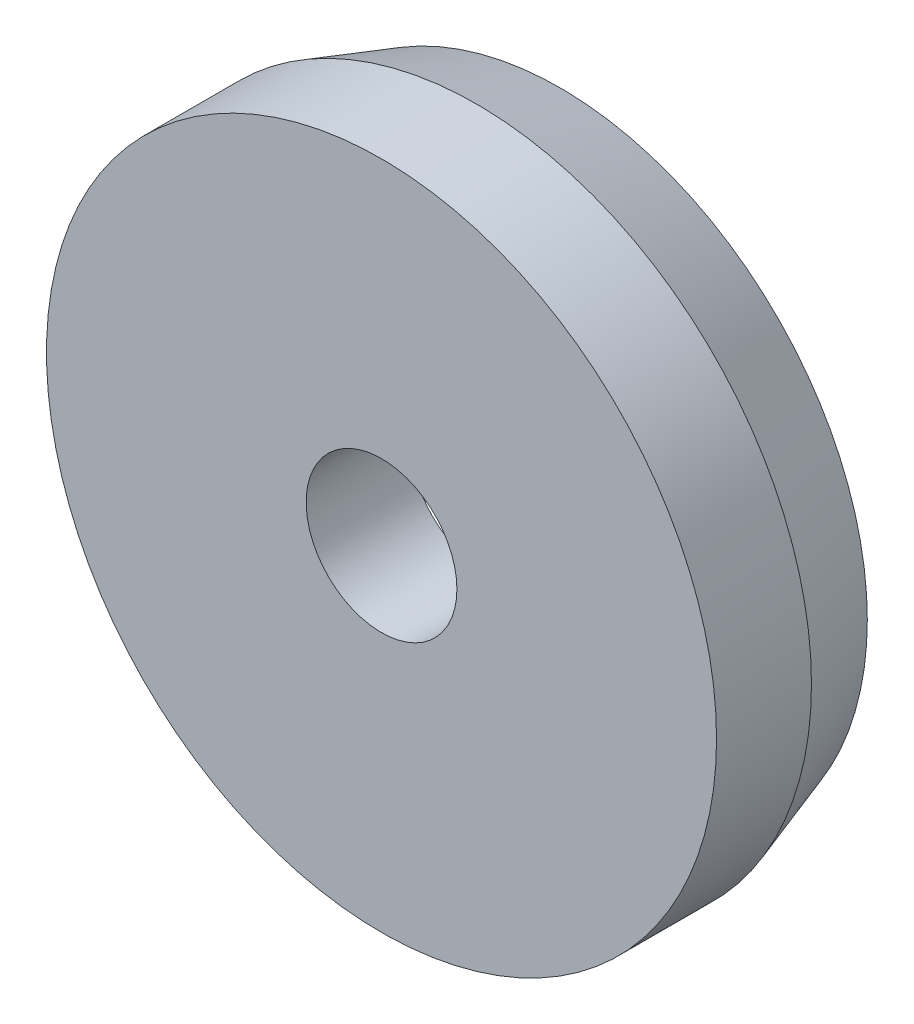
ISO-10303-21;
HEADER;
FILE_DESCRIPTION(('STEP AP214'),'2;1');
FILE_NAME('part.step','',(''),(''),'','','');
FILE_SCHEMA(('AUTOMOTIVE_DESIGN { 1 0 10303 214 1 1 1 1 }'));
ENDSEC;
DATA;
#1=APPLICATION_CONTEXT('core data for automotive mechanical design processes');
#2=APPLICATION_PROTOCOL_DEFINITION('international standard','automotive_design',2000,#1);
#3=PRODUCT_CONTEXT('',#1,'mechanical');
#4=PRODUCT('Part','Part','',(#3));
#5=PRODUCT_RELATED_PRODUCT_CATEGORY('part','',(#4));
#6=PRODUCT_DEFINITION_FORMATION('','',#4);
#7=PRODUCT_DEFINITION_CONTEXT('part definition',#1,'design');
#8=PRODUCT_DEFINITION('design','',#6,#7);
#9=PRODUCT_DEFINITION_SHAPE('','',#8);
#10=(LENGTH_UNIT() NAMED_UNIT(*) SI_UNIT(.MILLI.,.METRE.));
#11=(NAMED_UNIT(*) PLANE_ANGLE_UNIT() SI_UNIT($,.RADIAN.));
#12=(NAMED_UNIT(*) SI_UNIT($,.STERADIAN.) SOLID_ANGLE_UNIT());
#13=UNCERTAINTY_MEASURE_WITH_UNIT(LENGTH_MEASURE(1.E-05),#10,'distance_accuracy_value','');
#14=(GEOMETRIC_REPRESENTATION_CONTEXT(3) GLOBAL_UNCERTAINTY_ASSIGNED_CONTEXT((#13)) GLOBAL_UNIT_ASSIGNED_CONTEXT((#10,
#11,#12)) REPRESENTATION_CONTEXT('',''));
#15=CARTESIAN_POINT('',(0.,0.,0.));
#16=DIRECTION('',(0.,0.,1.));
#17=DIRECTION('',(1.,0.,0.));
#18=AXIS2_PLACEMENT_3D('',#15,#16,#17);
#19=CARTESIAN_POINT('',(0.,-10.25,-1.99));
#20=DIRECTION('',(0.,0.,1.));
#21=DIRECTION('',(1.,0.,0.));
#22=AXIS2_PLACEMENT_3D('',#19,#20,#21);
#23=CYLINDRICAL_SURFACE('',#22,0.600000000000001);
#24=CARTESIAN_POINT('',(0.,-10.25,-1.84));
#25=DIRECTION('',(0.,0.,1.));
#26=DIRECTION('',(1.,0.,0.));
#27=AXIS2_PLACEMENT_3D('',#24,#25,#26);
#28=CIRCLE('',#27,0.600000000000001);
#29=CARTESIAN_POINT('',(0.6,-10.25,-1.84));
#30=VERTEX_POINT('',#29);
#31=EDGE_CURVE('E52',#30,#30,#28,.T.);
#32=ORIENTED_EDGE('',*,*,#31,.T.);
#33=EDGE_LOOP('',(#32));
#34=FACE_BOUND('',#33,.T.);
#35=CARTESIAN_POINT('',(0.,-10.25,-1.67));
#36=DIRECTION('',(0.,0.,1.));
#37=DIRECTION('',(1.,0.,0.));
#38=AXIS2_PLACEMENT_3D('',#35,#36,#37);
#39=CIRCLE('',#38,0.600000000000001);
#40=CARTESIAN_POINT('',(0.6,-10.25,-1.67));
#41=VERTEX_POINT('',#40);
#42=EDGE_CURVE('E10',#41,#41,#39,.T.);
#43=ORIENTED_EDGE('',*,*,#42,.F.);
#44=EDGE_LOOP('',(#43));
#45=FACE_BOUND('',#44,.T.);
#46=ADVANCED_FACE('F30',(#34,#45),#23,.T.);
#47=CARTESIAN_POINT('',(0.134999999999999,-10.25,-1.67));
#48=DIRECTION('',(0.,0.,1.));
#49=DIRECTION('',(1.,0.,0.));
#50=AXIS2_PLACEMENT_3D('',#47,#48,#49);
#51=PLANE('',#50);
#52=ORIENTED_EDGE('',*,*,#42,.T.);
#53=EDGE_LOOP('',(#52));
#54=FACE_BOUND('',#53,.T.);
#55=CARTESIAN_POINT('',(0.,-10.25,-1.67));
#56=DIRECTION('',(0.,0.,1.));
#57=DIRECTION('',(1.,0.,0.));
#58=AXIS2_PLACEMENT_3D('',#55,#56,#57);
#59=CIRCLE('',#58,0.135);
#60=CARTESIAN_POINT('',(0.134999999999999,-10.25,-1.67));
#61=VERTEX_POINT('',#60);
#62=EDGE_CURVE('E36',#61,#61,#59,.T.);
#63=ORIENTED_EDGE('',*,*,#62,.F.);
#64=EDGE_LOOP('',(#63));
#65=FACE_BOUND('',#64,.T.);
#66=ADVANCED_FACE('F70',(#54,#65),#51,.T.);
#67=CARTESIAN_POINT('',(0.,-10.25,-1.99));
#68=DIRECTION('',(0.,0.,1.));
#69=DIRECTION('',(1.,0.,0.));
#70=AXIS2_PLACEMENT_3D('',#67,#68,#69);
#71=CYLINDRICAL_SURFACE('',#70,0.135);
#72=ORIENTED_EDGE('',*,*,#62,.T.);
#73=EDGE_LOOP('',(#72));
#74=FACE_BOUND('',#73,.T.);
#75=CARTESIAN_POINT('',(0.,-10.25,-1.85662806397071));
#76=DIRECTION('',(0.,0.,1.));
#77=DIRECTION('',(1.,0.,0.));
#78=AXIS2_PLACEMENT_3D('',#75,#76,#77);
#79=CIRCLE('',#78,0.135000000000001);
#80=CARTESIAN_POINT('',(0.134999999999999,-10.25,-1.85662806397071));
#81=VERTEX_POINT('',#80);
#82=EDGE_CURVE('E40',#81,#81,#79,.T.);
#83=ORIENTED_EDGE('',*,*,#82,.F.);
#84=EDGE_LOOP('',(#83));
#85=FACE_BOUND('',#84,.T.);
#86=ADVANCED_FACE('F74',(#74,#85),#71,.F.);
#87=CARTESIAN_POINT('',(0.,-10.25,-2.39633333333334));
#88=DIRECTION('',(0.,0.,1.));
#89=DIRECTION('',(1.,0.,0.));
#90=AXIS2_PLACEMENT_3D('',#87,#88,#89);
#91=SPHERICAL_SURFACE('',#90,0.556333333333336);
#92=ORIENTED_EDGE('',*,*,#82,.T.);
#93=EDGE_LOOP('',(#92));
#94=FACE_BOUND('',#93,.T.);
#95=CARTESIAN_POINT('',(0.,-10.25,-1.99));
#96=DIRECTION('',(0.,0.,1.));
#97=DIRECTION('',(1.,0.,0.));
#98=AXIS2_PLACEMENT_3D('',#95,#96,#97);
#99=CIRCLE('',#98,0.380000000000001);
#100=CARTESIAN_POINT('',(0.38,-10.25,-1.99));
#101=VERTEX_POINT('',#100);
#102=EDGE_CURVE('E44',#101,#101,#99,.T.);
#103=ORIENTED_EDGE('',*,*,#102,.F.);
#104=EDGE_LOOP('',(#103));
#105=FACE_BOUND('',#104,.T.);
#106=ADVANCED_FACE('F66',(#94,#105),#91,.F.);
#107=CARTESIAN_POINT('',(0.55,-10.25,-1.99));
#108=DIRECTION('',(0.,0.,-1.));
#109=DIRECTION('',(-1.,0.,0.));
#110=AXIS2_PLACEMENT_3D('',#107,#108,#109);
#111=PLANE('',#110);
#112=ORIENTED_EDGE('',*,*,#102,.T.);
#113=EDGE_LOOP('',(#112));
#114=FACE_BOUND('',#113,.T.);
#115=CARTESIAN_POINT('',(0.,-10.25,-1.99));
#116=DIRECTION('',(0.,0.,1.));
#117=DIRECTION('',(1.,0.,0.));
#118=AXIS2_PLACEMENT_3D('',#115,#116,#117);
#119=CIRCLE('',#118,0.550000000000001);
#120=CARTESIAN_POINT('',(0.55,-10.25,-1.99));
#121=VERTEX_POINT('',#120);
#122=EDGE_CURVE('E49',#121,#121,#119,.T.);
#123=ORIENTED_EDGE('',*,*,#122,.F.);
#124=EDGE_LOOP('',(#123));
#125=FACE_BOUND('',#124,.T.);
#126=ADVANCED_FACE('F60',(#114,#125),#111,.T.);
#127=CARTESIAN_POINT('',(0.,-10.25,-1.84));
#128=DIRECTION('',(0.,0.,1.));
#129=DIRECTION('',(1.,0.,0.));
#130=AXIS2_PLACEMENT_3D('',#127,#128,#129);
#131=CONICAL_SURFACE('',#130,0.600000000000001,0.32175055439664);
#132=ORIENTED_EDGE('',*,*,#122,.T.);
#133=EDGE_LOOP('',(#132));
#134=FACE_BOUND('',#133,.T.);
#135=ORIENTED_EDGE('',*,*,#31,.F.);
#136=EDGE_LOOP('',(#135));
#137=FACE_BOUND('',#136,.T.);
#138=ADVANCED_FACE('F58',(#134,#137),#131,.T.);
#139=CLOSED_SHELL('',(#46,#66,#86,#106,#126,#138));
#140=MANIFOLD_SOLID_BREP('B2',#139);
#141=ADVANCED_BREP_SHAPE_REPRESENTATION('',(#18,#140),#14);
#142=SHAPE_DEFINITION_REPRESENTATION(#9,#141);
ENDSEC;
END-ISO-10303-21;
